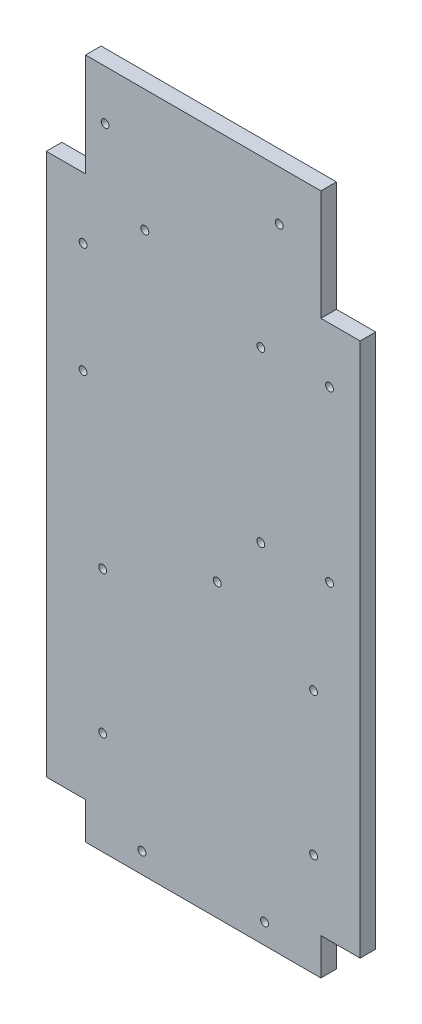
ISO-10303-21;
HEADER;
FILE_DESCRIPTION(('STEP AP214'),'2;1');
FILE_NAME('part.step','',(''),(''),'','','');
FILE_SCHEMA(('AUTOMOTIVE_DESIGN { 1 0 10303 214 1 1 1 1 }'));
ENDSEC;
DATA;
#1=APPLICATION_CONTEXT('core data for automotive mechanical design processes');
#2=APPLICATION_PROTOCOL_DEFINITION('international standard','automotive_design',2000,#1);
#3=PRODUCT_CONTEXT('',#1,'mechanical');
#4=PRODUCT('Part','Part','',(#3));
#5=PRODUCT_RELATED_PRODUCT_CATEGORY('part','',(#4));
#6=PRODUCT_DEFINITION_FORMATION('','',#4);
#7=PRODUCT_DEFINITION_CONTEXT('part definition',#1,'design');
#8=PRODUCT_DEFINITION('design','',#6,#7);
#9=PRODUCT_DEFINITION_SHAPE('','',#8);
#10=(LENGTH_UNIT() NAMED_UNIT(*) SI_UNIT(.MILLI.,.METRE.));
#11=(NAMED_UNIT(*) PLANE_ANGLE_UNIT() SI_UNIT($,.RADIAN.));
#12=(NAMED_UNIT(*) SI_UNIT($,.STERADIAN.) SOLID_ANGLE_UNIT());
#13=UNCERTAINTY_MEASURE_WITH_UNIT(LENGTH_MEASURE(1.E-05),#10,'distance_accuracy_value','');
#14=(GEOMETRIC_REPRESENTATION_CONTEXT(3) GLOBAL_UNCERTAINTY_ASSIGNED_CONTEXT((#13)) GLOBAL_UNIT_ASSIGNED_CONTEXT((#10,
#11,#12)) REPRESENTATION_CONTEXT('',''));
#15=CARTESIAN_POINT('',(0.,0.,0.));
#16=DIRECTION('',(0.,0.,1.));
#17=DIRECTION('',(1.,0.,0.));
#18=AXIS2_PLACEMENT_3D('',#15,#16,#17);
#19=CARTESIAN_POINT('',(0.,0.,6.35));
#20=DIRECTION('',(1.,0.,0.));
#21=DIRECTION('',(0.,0.,-1.));
#22=AXIS2_PLACEMENT_3D('',#19,#20,#21);
#23=PLANE('',#22);
#24=DIRECTION('',(0.,-1.,0.));
#25=VECTOR('',#24,1.);
#26=CARTESIAN_POINT('',(0.,0.,0.));
#27=LINE('',#26,#25);
#28=CARTESIAN_POINT('',(0.,236.,0.));
#29=VERTEX_POINT('',#28);
#30=CARTESIAN_POINT('',(0.,15.,0.));
#31=VERTEX_POINT('',#30);
#32=EDGE_CURVE('E169',#29,#31,#27,.T.);
#33=ORIENTED_EDGE('',*,*,#32,.T.);
#34=DIRECTION('',(0.,0.,1.));
#35=VECTOR('',#34,1.);
#36=CARTESIAN_POINT('',(0.,15.,-25.4125));
#37=LINE('',#36,#35);
#38=CARTESIAN_POINT('',(0.,15.,6.35));
#39=VERTEX_POINT('',#38);
#40=EDGE_CURVE('E280',#31,#39,#37,.T.);
#41=ORIENTED_EDGE('',*,*,#40,.T.);
#42=DIRECTION('',(0.,-1.,0.));
#43=VECTOR('',#42,1.);
#44=CARTESIAN_POINT('',(0.,0.,6.35));
#45=LINE('',#44,#43);
#46=CARTESIAN_POINT('',(0.,236.,6.35));
#47=VERTEX_POINT('',#46);
#48=EDGE_CURVE('E183',#47,#39,#45,.T.);
#49=ORIENTED_EDGE('',*,*,#48,.F.);
#50=DIRECTION('',(0.,0.,1.));
#51=VECTOR('',#50,1.);
#52=CARTESIAN_POINT('',(0.,236.,-25.4125));
#53=LINE('',#52,#51);
#54=EDGE_CURVE('E297',#29,#47,#53,.T.);
#55=ORIENTED_EDGE('',*,*,#54,.F.);
#56=EDGE_LOOP('',(#33,#41,#49,#55));
#57=FACE_BOUND('',#56,.T.);
#58=ADVANCED_FACE('F39',(#57),#23,.F.);
#59=CARTESIAN_POINT('',(0.,0.,6.35));
#60=DIRECTION('',(0.,1.,0.));
#61=DIRECTION('',(0.,0.,1.));
#62=AXIS2_PLACEMENT_3D('',#59,#60,#61);
#63=PLANE('',#62);
#64=DIRECTION('',(1.,0.,0.));
#65=VECTOR('',#64,1.);
#66=CARTESIAN_POINT('',(0.,0.,6.35));
#67=LINE('',#66,#65);
#68=CARTESIAN_POINT('',(16.,0.,6.35));
#69=VERTEX_POINT('',#68);
#70=CARTESIAN_POINT('',(112.,0.,6.35));
#71=VERTEX_POINT('',#70);
#72=EDGE_CURVE('E165',#69,#71,#67,.T.);
#73=ORIENTED_EDGE('',*,*,#72,.F.);
#74=DIRECTION('',(0.,0.,1.));
#75=VECTOR('',#74,1.);
#76=CARTESIAN_POINT('',(16.,0.,-25.4125));
#77=LINE('',#76,#75);
#78=CARTESIAN_POINT('',(16.,0.,0.));
#79=VERTEX_POINT('',#78);
#80=EDGE_CURVE('E274',#79,#69,#77,.T.);
#81=ORIENTED_EDGE('',*,*,#80,.F.);
#82=DIRECTION('',(1.,0.,0.));
#83=VECTOR('',#82,1.);
#84=CARTESIAN_POINT('',(0.,0.,0.));
#85=LINE('',#84,#83);
#86=CARTESIAN_POINT('',(112.,0.,0.));
#87=VERTEX_POINT('',#86);
#88=EDGE_CURVE('E173',#79,#87,#85,.T.);
#89=ORIENTED_EDGE('',*,*,#88,.T.);
#90=DIRECTION('',(0.,0.,1.));
#91=VECTOR('',#90,1.);
#92=CARTESIAN_POINT('',(112.,0.,-25.4125));
#93=LINE('',#92,#91);
#94=EDGE_CURVE('E152',#87,#71,#93,.T.);
#95=ORIENTED_EDGE('',*,*,#94,.T.);
#96=EDGE_LOOP('',(#73,#81,#89,#95));
#97=FACE_BOUND('',#96,.T.);
#98=ADVANCED_FACE('F315',(#97),#63,.F.);
#99=CARTESIAN_POINT('',(128.,0.,6.35));
#100=DIRECTION('',(-1.,0.,0.));
#101=DIRECTION('',(0.,0.,1.));
#102=AXIS2_PLACEMENT_3D('',#99,#100,#101);
#103=PLANE('',#102);
#104=DIRECTION('',(0.,1.,0.));
#105=VECTOR('',#104,1.);
#106=CARTESIAN_POINT('',(128.,0.,6.35));
#107=LINE('',#106,#105);
#108=CARTESIAN_POINT('',(128.,15.,6.35));
#109=VERTEX_POINT('',#108);
#110=CARTESIAN_POINT('',(128.,233.,6.35));
#111=VERTEX_POINT('',#110);
#112=EDGE_CURVE('E159',#109,#111,#107,.T.);
#113=ORIENTED_EDGE('',*,*,#112,.F.);
#114=DIRECTION('',(0.,0.,1.));
#115=VECTOR('',#114,1.);
#116=CARTESIAN_POINT('',(128.,15.,-25.4125));
#117=LINE('',#116,#115);
#118=CARTESIAN_POINT('',(128.,15.,0.));
#119=VERTEX_POINT('',#118);
#120=EDGE_CURVE('E277',#119,#109,#117,.T.);
#121=ORIENTED_EDGE('',*,*,#120,.F.);
#122=DIRECTION('',(0.,1.,0.));
#123=VECTOR('',#122,1.);
#124=CARTESIAN_POINT('',(128.,0.,0.));
#125=LINE('',#124,#123);
#126=CARTESIAN_POINT('',(128.,233.,0.));
#127=VERTEX_POINT('',#126);
#128=EDGE_CURVE('E177',#119,#127,#125,.T.);
#129=ORIENTED_EDGE('',*,*,#128,.T.);
#130=DIRECTION('',(0.,0.,1.));
#131=VECTOR('',#130,1.);
#132=CARTESIAN_POINT('',(128.,233.,-25.4125));
#133=LINE('',#132,#131);
#134=EDGE_CURVE('E294',#127,#111,#133,.T.);
#135=ORIENTED_EDGE('',*,*,#134,.T.);
#136=EDGE_LOOP('',(#113,#121,#129,#135));
#137=FACE_BOUND('',#136,.T.);
#138=ADVANCED_FACE('F437',(#137),#103,.F.);
#139=CARTESIAN_POINT('',(0.,278.,6.35));
#140=DIRECTION('',(0.,-1.,0.));
#141=DIRECTION('',(0.,0.,-1.));
#142=AXIS2_PLACEMENT_3D('',#139,#140,#141);
#143=PLANE('',#142);
#144=DIRECTION('',(-1.,0.,0.));
#145=VECTOR('',#144,1.);
#146=CARTESIAN_POINT('',(0.,278.,6.35));
#147=LINE('',#146,#145);
#148=CARTESIAN_POINT('',(112.,278.,6.35));
#149=VERTEX_POINT('',#148);
#150=CARTESIAN_POINT('',(16.,278.,6.35));
#151=VERTEX_POINT('',#150);
#152=EDGE_CURVE('E149',#149,#151,#147,.T.);
#153=ORIENTED_EDGE('',*,*,#152,.F.);
#154=DIRECTION('',(0.,0.,1.));
#155=VECTOR('',#154,1.);
#156=CARTESIAN_POINT('',(112.,278.,-25.4125));
#157=LINE('',#156,#155);
#158=CARTESIAN_POINT('',(112.,278.,0.));
#159=VERTEX_POINT('',#158);
#160=EDGE_CURVE('E129',#159,#149,#157,.T.);
#161=ORIENTED_EDGE('',*,*,#160,.F.);
#162=DIRECTION('',(-1.,0.,0.));
#163=VECTOR('',#162,1.);
#164=CARTESIAN_POINT('',(0.,278.,0.));
#165=LINE('',#164,#163);
#166=CARTESIAN_POINT('',(16.,278.,0.));
#167=VERTEX_POINT('',#166);
#168=EDGE_CURVE('E181',#159,#167,#165,.T.);
#169=ORIENTED_EDGE('',*,*,#168,.T.);
#170=DIRECTION('',(0.,0.,1.));
#171=VECTOR('',#170,1.);
#172=CARTESIAN_POINT('',(16.,278.,-25.4125));
#173=LINE('',#172,#171);
#174=EDGE_CURVE('E156',#167,#151,#173,.T.);
#175=ORIENTED_EDGE('',*,*,#174,.T.);
#176=EDGE_LOOP('',(#153,#161,#169,#175));
#177=FACE_BOUND('',#176,.T.);
#178=ADVANCED_FACE('F155',(#177),#143,.F.);
#179=CARTESIAN_POINT('',(0.,0.,6.35));
#180=DIRECTION('',(0.,0.,-1.));
#181=DIRECTION('',(-1.,0.,0.));
#182=AXIS2_PLACEMENT_3D('',#179,#180,#181);
#183=PLANE('',#182);
#184=CARTESIAN_POINT('',(15.,211.,6.35));
#185=DIRECTION('',(0.,0.,1.));
#186=DIRECTION('',(1.,0.,0.));
#187=AXIS2_PLACEMENT_3D('',#184,#185,#186);
#188=CIRCLE('',#187,1.6);
#189=CARTESIAN_POINT('',(16.6,211.,6.35));
#190=VERTEX_POINT('',#189);
#191=EDGE_CURVE('E354',#190,#190,#188,.T.);
#192=ORIENTED_EDGE('',*,*,#191,.F.);
#193=EDGE_LOOP('',(#192));
#194=FACE_BOUND('',#193,.T.);
#195=CARTESIAN_POINT('',(40.197400927512,228.25,6.35));
#196=DIRECTION('',(0.,0.,1.));
#197=DIRECTION('',(1.,0.,0.));
#198=AXIS2_PLACEMENT_3D('',#195,#196,#197);
#199=CIRCLE('',#198,1.60000000000002);
#200=CARTESIAN_POINT('',(41.797400927512,228.25,6.35));
#201=VERTEX_POINT('',#200);
#202=EDGE_CURVE('E358',#201,#201,#199,.T.);
#203=ORIENTED_EDGE('',*,*,#202,.F.);
#204=EDGE_LOOP('',(#203));
#205=FACE_BOUND('',#204,.T.);
#206=CARTESIAN_POINT('',(69.697400927512,118.75,6.35));
#207=DIRECTION('',(0.,0.,1.));
#208=DIRECTION('',(1.,0.,0.));
#209=AXIS2_PLACEMENT_3D('',#206,#207,#208);
#210=CIRCLE('',#209,1.60000000000001);
#211=CARTESIAN_POINT('',(71.297400927512,118.75,6.35));
#212=VERTEX_POINT('',#211);
#213=EDGE_CURVE('E363',#212,#212,#210,.T.);
#214=ORIENTED_EDGE('',*,*,#213,.F.);
#215=EDGE_LOOP('',(#214));
#216=FACE_BOUND('',#215,.T.);
#217=CARTESIAN_POINT('',(115.5,141.5,6.35));
#218=DIRECTION('',(0.,0.,1.));
#219=DIRECTION('',(1.,0.,0.));
#220=AXIS2_PLACEMENT_3D('',#217,#218,#219);
#221=CIRCLE('',#220,1.6);
#222=CARTESIAN_POINT('',(117.1,141.5,6.35));
#223=VERTEX_POINT('',#222);
#224=EDGE_CURVE('E350',#223,#223,#221,.T.);
#225=ORIENTED_EDGE('',*,*,#224,.F.);
#226=EDGE_LOOP('',(#225));
#227=FACE_BOUND('',#226,.T.);
#228=CARTESIAN_POINT('',(95.,257.75,6.35));
#229=DIRECTION('',(0.,0.,1.));
#230=DIRECTION('',(1.,0.,0.));
#231=AXIS2_PLACEMENT_3D('',#228,#229,#230);
#232=CIRCLE('',#231,1.59999999999998);
#233=CARTESIAN_POINT('',(96.6,257.75,6.35));
#234=VERTEX_POINT('',#233);
#235=EDGE_CURVE('E337',#234,#234,#232,.T.);
#236=ORIENTED_EDGE('',*,*,#235,.F.);
#237=EDGE_LOOP('',(#236));
#238=FACE_BOUND('',#237,.T.);
#239=CARTESIAN_POINT('',(87.5,210.5,6.35));
#240=DIRECTION('',(0.,0.,1.));
#241=DIRECTION('',(1.,0.,0.));
#242=AXIS2_PLACEMENT_3D('',#239,#240,#241);
#243=CIRCLE('',#242,1.6);
#244=CARTESIAN_POINT('',(89.1,210.5,6.35));
#245=VERTEX_POINT('',#244);
#246=EDGE_CURVE('E338',#245,#245,#243,.T.);
#247=ORIENTED_EDGE('',*,*,#246,.F.);
#248=EDGE_LOOP('',(#247));
#249=FACE_BOUND('',#248,.T.);
#250=CARTESIAN_POINT('',(115.5,210.5,6.35));
#251=DIRECTION('',(0.,0.,1.));
#252=DIRECTION('',(1.,0.,0.));
#253=AXIS2_PLACEMENT_3D('',#250,#251,#252);
#254=CIRCLE('',#253,1.6);
#255=CARTESIAN_POINT('',(117.1,210.5,6.35));
#256=VERTEX_POINT('',#255);
#257=EDGE_CURVE('E342',#256,#256,#254,.T.);
#258=ORIENTED_EDGE('',*,*,#257,.F.);
#259=EDGE_LOOP('',(#258));
#260=FACE_BOUND('',#259,.T.);
#261=CARTESIAN_POINT('',(87.5,141.5,6.35));
#262=DIRECTION('',(0.,0.,1.));
#263=DIRECTION('',(1.,0.,0.));
#264=AXIS2_PLACEMENT_3D('',#261,#262,#263);
#265=CIRCLE('',#264,1.6);
#266=CARTESIAN_POINT('',(89.1,141.5,6.35));
#267=VERTEX_POINT('',#266);
#268=EDGE_CURVE('E346',#267,#267,#265,.T.);
#269=ORIENTED_EDGE('',*,*,#268,.F.);
#270=EDGE_LOOP('',(#269));
#271=FACE_BOUND('',#270,.T.);
#272=CARTESIAN_POINT('',(109.,100.,6.35));
#273=DIRECTION('',(0.,0.,1.));
#274=DIRECTION('',(1.,0.,0.));
#275=AXIS2_PLACEMENT_3D('',#272,#273,#274);
#276=CIRCLE('',#275,1.60000000000001);
#277=CARTESIAN_POINT('',(110.6,100.,6.35));
#278=VERTEX_POINT('',#277);
#279=EDGE_CURVE('E386',#278,#278,#276,.T.);
#280=ORIENTED_EDGE('',*,*,#279,.F.);
#281=EDGE_LOOP('',(#280));
#282=FACE_BOUND('',#281,.T.);
#283=CARTESIAN_POINT('',(109.,42.,6.35));
#284=DIRECTION('',(0.,0.,1.));
#285=DIRECTION('',(1.,0.,0.));
#286=AXIS2_PLACEMENT_3D('',#283,#284,#285);
#287=CIRCLE('',#286,1.60000000000001);
#288=CARTESIAN_POINT('',(110.6,42.,6.35));
#289=VERTEX_POINT('',#288);
#290=EDGE_CURVE('E390',#289,#289,#287,.T.);
#291=ORIENTED_EDGE('',*,*,#290,.F.);
#292=EDGE_LOOP('',(#291));
#293=FACE_BOUND('',#292,.T.);
#294=CARTESIAN_POINT('',(23.,42.,6.35));
#295=DIRECTION('',(0.,0.,1.));
#296=DIRECTION('',(1.,0.,0.));
#297=AXIS2_PLACEMENT_3D('',#294,#295,#296);
#298=CIRCLE('',#297,1.6);
#299=CARTESIAN_POINT('',(24.6,42.,6.35));
#300=VERTEX_POINT('',#299);
#301=EDGE_CURVE('E382',#300,#300,#298,.T.);
#302=ORIENTED_EDGE('',*,*,#301,.F.);
#303=EDGE_LOOP('',(#302));
#304=FACE_BOUND('',#303,.T.);
#305=CARTESIAN_POINT('',(15.,166.,6.35));
#306=DIRECTION('',(0.,0.,1.));
#307=DIRECTION('',(1.,0.,0.));
#308=AXIS2_PLACEMENT_3D('',#305,#306,#307);
#309=CIRCLE('',#308,1.60000000000003);
#310=CARTESIAN_POINT('',(16.6,166.,6.35));
#311=VERTEX_POINT('',#310);
#312=EDGE_CURVE('E359',#311,#311,#309,.T.);
#313=ORIENTED_EDGE('',*,*,#312,.F.);
#314=EDGE_LOOP('',(#313));
#315=FACE_BOUND('',#314,.T.);
#316=CARTESIAN_POINT('',(39.,8.30892703083148,6.35));
#317=DIRECTION('',(0.,0.,1.));
#318=DIRECTION('',(1.,0.,0.));
#319=AXIS2_PLACEMENT_3D('',#316,#317,#318);
#320=CIRCLE('',#319,1.6);
#321=CARTESIAN_POINT('',(40.6,8.30892703083148,6.35));
#322=VERTEX_POINT('',#321);
#323=EDGE_CURVE('E370',#322,#322,#320,.T.);
#324=ORIENTED_EDGE('',*,*,#323,.F.);
#325=EDGE_LOOP('',(#324));
#326=FACE_BOUND('',#325,.T.);
#327=CARTESIAN_POINT('',(89.,8.3089270308315,6.35));
#328=DIRECTION('',(0.,0.,1.));
#329=DIRECTION('',(1.,0.,0.));
#330=AXIS2_PLACEMENT_3D('',#327,#328,#329);
#331=CIRCLE('',#330,1.6);
#332=CARTESIAN_POINT('',(90.6,8.3089270308315,6.35));
#333=VERTEX_POINT('',#332);
#334=EDGE_CURVE('E374',#333,#333,#331,.T.);
#335=ORIENTED_EDGE('',*,*,#334,.F.);
#336=EDGE_LOOP('',(#335));
#337=FACE_BOUND('',#336,.T.);
#338=CARTESIAN_POINT('',(23.,100.,6.35));
#339=DIRECTION('',(0.,0.,1.));
#340=DIRECTION('',(1.,0.,0.));
#341=AXIS2_PLACEMENT_3D('',#338,#339,#340);
#342=CIRCLE('',#341,1.60000000000001);
#343=CARTESIAN_POINT('',(24.6,100.,6.35));
#344=VERTEX_POINT('',#343);
#345=EDGE_CURVE('E378',#344,#344,#342,.T.);
#346=ORIENTED_EDGE('',*,*,#345,.F.);
#347=EDGE_LOOP('',(#346));
#348=FACE_BOUND('',#347,.T.);
#349=CARTESIAN_POINT('',(24.,257.75,6.35));
#350=DIRECTION('',(0.,0.,1.));
#351=DIRECTION('',(1.,0.,0.));
#352=AXIS2_PLACEMENT_3D('',#349,#350,#351);
#353=CIRCLE('',#352,1.6);
#354=CARTESIAN_POINT('',(25.6,257.75,6.35));
#355=VERTEX_POINT('',#354);
#356=EDGE_CURVE('E207',#355,#355,#353,.T.);
#357=ORIENTED_EDGE('',*,*,#356,.F.);
#358=EDGE_LOOP('',(#357));
#359=FACE_BOUND('',#358,.T.);
#360=ORIENTED_EDGE('',*,*,#48,.T.);
#361=DIRECTION('',(-1.,0.,0.));
#362=VECTOR('',#361,1.);
#363=CARTESIAN_POINT('',(0.,15.,6.35));
#364=LINE('',#363,#362);
#365=CARTESIAN_POINT('',(16.,15.,6.35));
#366=VERTEX_POINT('',#365);
#367=EDGE_CURVE('E269',#366,#39,#364,.T.);
#368=ORIENTED_EDGE('',*,*,#367,.F.);
#369=DIRECTION('',(0.,1.,0.));
#370=VECTOR('',#369,1.);
#371=CARTESIAN_POINT('',(16.,0.,6.35));
#372=LINE('',#371,#370);
#373=EDGE_CURVE('E265',#69,#366,#372,.T.);
#374=ORIENTED_EDGE('',*,*,#373,.F.);
#375=ORIENTED_EDGE('',*,*,#72,.T.);
#376=DIRECTION('',(0.,-1.,0.));
#377=VECTOR('',#376,1.);
#378=CARTESIAN_POINT('',(112.,0.,6.35));
#379=LINE('',#378,#377);
#380=CARTESIAN_POINT('',(112.,15.,6.35));
#381=VERTEX_POINT('',#380);
#382=EDGE_CURVE('E311',#381,#71,#379,.T.);
#383=ORIENTED_EDGE('',*,*,#382,.F.);
#384=DIRECTION('',(-1.,0.,0.));
#385=VECTOR('',#384,1.);
#386=CARTESIAN_POINT('',(128.,15.,6.35));
#387=LINE('',#386,#385);
#388=EDGE_CURVE('E284',#109,#381,#387,.T.);
#389=ORIENTED_EDGE('',*,*,#388,.F.);
#390=ORIENTED_EDGE('',*,*,#112,.T.);
#391=DIRECTION('',(1.,0.,0.));
#392=VECTOR('',#391,1.);
#393=CARTESIAN_POINT('',(128.,233.,6.35));
#394=LINE('',#393,#392);
#395=CARTESIAN_POINT('',(112.,233.,6.35));
#396=VERTEX_POINT('',#395);
#397=EDGE_CURVE('E142',#396,#111,#394,.T.);
#398=ORIENTED_EDGE('',*,*,#397,.F.);
#399=DIRECTION('',(0.,-1.,0.));
#400=VECTOR('',#399,1.);
#401=CARTESIAN_POINT('',(112.,278.,6.35));
#402=LINE('',#401,#400);
#403=EDGE_CURVE('E132',#149,#396,#402,.T.);
#404=ORIENTED_EDGE('',*,*,#403,.F.);
#405=ORIENTED_EDGE('',*,*,#152,.T.);
#406=DIRECTION('',(0.,1.,0.));
#407=VECTOR('',#406,1.);
#408=CARTESIAN_POINT('',(16.,278.,6.35));
#409=LINE('',#408,#407);
#410=CARTESIAN_POINT('',(16.,236.,6.35));
#411=VERTEX_POINT('',#410);
#412=EDGE_CURVE('E293',#411,#151,#409,.T.);
#413=ORIENTED_EDGE('',*,*,#412,.F.);
#414=DIRECTION('',(1.,0.,0.));
#415=VECTOR('',#414,1.);
#416=CARTESIAN_POINT('',(0.,236.,6.35));
#417=LINE('',#416,#415);
#418=EDGE_CURVE('E289',#47,#411,#417,.T.);
#419=ORIENTED_EDGE('',*,*,#418,.F.);
#420=EDGE_LOOP('',(#360,#368,#374,#375,#383,#389,#390,#398,#404,#405,#413,#419));
#421=FACE_BOUND('',#420,.T.);
#422=ADVANCED_FACE('F147',(#194,#205,#216,#227,#238,#249,#260,#271,#282,#293,#304,#315,#326,
#337,#348,#359,#421),#183,.F.);
#423=CARTESIAN_POINT('',(0.,0.,0.));
#424=DIRECTION('',(0.,0.,-1.));
#425=DIRECTION('',(-1.,0.,0.));
#426=AXIS2_PLACEMENT_3D('',#423,#424,#425);
#427=PLANE('',#426);
#428=CARTESIAN_POINT('',(15.,211.,0.));
#429=DIRECTION('',(0.,0.,-1.));
#430=DIRECTION('',(-1.,0.,0.));
#431=AXIS2_PLACEMENT_3D('',#428,#429,#430);
#432=CIRCLE('',#431,1.6);
#433=CARTESIAN_POINT('',(13.4,211.,0.));
#434=VERTEX_POINT('',#433);
#435=EDGE_CURVE('E42',#434,#434,#432,.T.);
#436=ORIENTED_EDGE('',*,*,#435,.F.);
#437=EDGE_LOOP('',(#436));
#438=FACE_BOUND('',#437,.T.);
#439=CARTESIAN_POINT('',(40.197400927512,228.25,0.));
#440=DIRECTION('',(0.,0.,-1.));
#441=DIRECTION('',(-1.,0.,0.));
#442=AXIS2_PLACEMENT_3D('',#439,#440,#441);
#443=CIRCLE('',#442,1.60000000000002);
#444=CARTESIAN_POINT('',(38.5974009275119,228.25,0.));
#445=VERTEX_POINT('',#444);
#446=EDGE_CURVE('E258',#445,#445,#443,.T.);
#447=ORIENTED_EDGE('',*,*,#446,.F.);
#448=EDGE_LOOP('',(#447));
#449=FACE_BOUND('',#448,.T.);
#450=CARTESIAN_POINT('',(69.697400927512,118.75,0.));
#451=DIRECTION('',(0.,0.,-1.));
#452=DIRECTION('',(-1.,0.,0.));
#453=AXIS2_PLACEMENT_3D('',#450,#451,#452);
#454=CIRCLE('',#453,1.60000000000001);
#455=CARTESIAN_POINT('',(68.097400927512,118.75,0.));
#456=VERTEX_POINT('',#455);
#457=EDGE_CURVE('E255',#456,#456,#454,.T.);
#458=ORIENTED_EDGE('',*,*,#457,.F.);
#459=EDGE_LOOP('',(#458));
#460=FACE_BOUND('',#459,.T.);
#461=CARTESIAN_POINT('',(115.5,141.5,0.));
#462=DIRECTION('',(0.,0.,-1.));
#463=DIRECTION('',(-1.,0.,0.));
#464=AXIS2_PLACEMENT_3D('',#461,#462,#463);
#465=CIRCLE('',#464,1.6);
#466=CARTESIAN_POINT('',(113.9,141.5,0.));
#467=VERTEX_POINT('',#466);
#468=EDGE_CURVE('E251',#467,#467,#465,.T.);
#469=ORIENTED_EDGE('',*,*,#468,.F.);
#470=EDGE_LOOP('',(#469));
#471=FACE_BOUND('',#470,.T.);
#472=CARTESIAN_POINT('',(95.,257.75,0.));
#473=DIRECTION('',(0.,0.,-1.));
#474=DIRECTION('',(-1.,0.,0.));
#475=AXIS2_PLACEMENT_3D('',#472,#473,#474);
#476=CIRCLE('',#475,1.59999999999998);
#477=CARTESIAN_POINT('',(93.4,257.75,0.));
#478=VERTEX_POINT('',#477);
#479=EDGE_CURVE('E247',#478,#478,#476,.T.);
#480=ORIENTED_EDGE('',*,*,#479,.F.);
#481=EDGE_LOOP('',(#480));
#482=FACE_BOUND('',#481,.T.);
#483=CARTESIAN_POINT('',(87.5,210.5,0.));
#484=DIRECTION('',(0.,0.,-1.));
#485=DIRECTION('',(-1.,0.,0.));
#486=AXIS2_PLACEMENT_3D('',#483,#484,#485);
#487=CIRCLE('',#486,1.6);
#488=CARTESIAN_POINT('',(85.9,210.5,0.));
#489=VERTEX_POINT('',#488);
#490=EDGE_CURVE('E243',#489,#489,#487,.T.);
#491=ORIENTED_EDGE('',*,*,#490,.F.);
#492=EDGE_LOOP('',(#491));
#493=FACE_BOUND('',#492,.T.);
#494=CARTESIAN_POINT('',(115.5,210.5,0.));
#495=DIRECTION('',(0.,0.,-1.));
#496=DIRECTION('',(-1.,0.,0.));
#497=AXIS2_PLACEMENT_3D('',#494,#495,#496);
#498=CIRCLE('',#497,1.6);
#499=CARTESIAN_POINT('',(113.9,210.5,0.));
#500=VERTEX_POINT('',#499);
#501=EDGE_CURVE('E239',#500,#500,#498,.T.);
#502=ORIENTED_EDGE('',*,*,#501,.F.);
#503=EDGE_LOOP('',(#502));
#504=FACE_BOUND('',#503,.T.);
#505=CARTESIAN_POINT('',(87.5,141.5,0.));
#506=DIRECTION('',(0.,0.,-1.));
#507=DIRECTION('',(-1.,0.,0.));
#508=AXIS2_PLACEMENT_3D('',#505,#506,#507);
#509=CIRCLE('',#508,1.6);
#510=CARTESIAN_POINT('',(85.9,141.5,0.));
#511=VERTEX_POINT('',#510);
#512=EDGE_CURVE('E235',#511,#511,#509,.T.);
#513=ORIENTED_EDGE('',*,*,#512,.F.);
#514=EDGE_LOOP('',(#513));
#515=FACE_BOUND('',#514,.T.);
#516=CARTESIAN_POINT('',(109.,100.,0.));
#517=DIRECTION('',(0.,0.,-1.));
#518=DIRECTION('',(-1.,0.,0.));
#519=AXIS2_PLACEMENT_3D('',#516,#517,#518);
#520=CIRCLE('',#519,1.60000000000001);
#521=CARTESIAN_POINT('',(107.4,100.,0.));
#522=VERTEX_POINT('',#521);
#523=EDGE_CURVE('E231',#522,#522,#520,.T.);
#524=ORIENTED_EDGE('',*,*,#523,.F.);
#525=EDGE_LOOP('',(#524));
#526=FACE_BOUND('',#525,.T.);
#527=CARTESIAN_POINT('',(109.,42.,0.));
#528=DIRECTION('',(0.,0.,-1.));
#529=DIRECTION('',(-1.,0.,0.));
#530=AXIS2_PLACEMENT_3D('',#527,#528,#529);
#531=CIRCLE('',#530,1.60000000000001);
#532=CARTESIAN_POINT('',(107.4,42.,0.));
#533=VERTEX_POINT('',#532);
#534=EDGE_CURVE('E227',#533,#533,#531,.T.);
#535=ORIENTED_EDGE('',*,*,#534,.F.);
#536=EDGE_LOOP('',(#535));
#537=FACE_BOUND('',#536,.T.);
#538=CARTESIAN_POINT('',(23.,42.,0.));
#539=DIRECTION('',(0.,0.,-1.));
#540=DIRECTION('',(-1.,0.,0.));
#541=AXIS2_PLACEMENT_3D('',#538,#539,#540);
#542=CIRCLE('',#541,1.6);
#543=CARTESIAN_POINT('',(21.4,42.,0.));
#544=VERTEX_POINT('',#543);
#545=EDGE_CURVE('E223',#544,#544,#542,.T.);
#546=ORIENTED_EDGE('',*,*,#545,.F.);
#547=EDGE_LOOP('',(#546));
#548=FACE_BOUND('',#547,.T.);
#549=CARTESIAN_POINT('',(15.,166.,0.));
#550=DIRECTION('',(0.,0.,-1.));
#551=DIRECTION('',(-1.,0.,0.));
#552=AXIS2_PLACEMENT_3D('',#549,#550,#551);
#553=CIRCLE('',#552,1.60000000000003);
#554=CARTESIAN_POINT('',(13.4,166.,0.));
#555=VERTEX_POINT('',#554);
#556=EDGE_CURVE('E219',#555,#555,#553,.T.);
#557=ORIENTED_EDGE('',*,*,#556,.F.);
#558=EDGE_LOOP('',(#557));
#559=FACE_BOUND('',#558,.T.);
#560=CARTESIAN_POINT('',(39.,8.30892703083148,0.));
#561=DIRECTION('',(0.,0.,-1.));
#562=DIRECTION('',(-1.,0.,0.));
#563=AXIS2_PLACEMENT_3D('',#560,#561,#562);
#564=CIRCLE('',#563,1.6);
#565=CARTESIAN_POINT('',(37.4,8.30892703083148,0.));
#566=VERTEX_POINT('',#565);
#567=EDGE_CURVE('E215',#566,#566,#564,.T.);
#568=ORIENTED_EDGE('',*,*,#567,.F.);
#569=EDGE_LOOP('',(#568));
#570=FACE_BOUND('',#569,.T.);
#571=CARTESIAN_POINT('',(89.,8.3089270308315,0.));
#572=DIRECTION('',(0.,0.,-1.));
#573=DIRECTION('',(-1.,0.,0.));
#574=AXIS2_PLACEMENT_3D('',#571,#572,#573);
#575=CIRCLE('',#574,1.6);
#576=CARTESIAN_POINT('',(87.4,8.3089270308315,0.));
#577=VERTEX_POINT('',#576);
#578=EDGE_CURVE('E211',#577,#577,#575,.T.);
#579=ORIENTED_EDGE('',*,*,#578,.F.);
#580=EDGE_LOOP('',(#579));
#581=FACE_BOUND('',#580,.T.);
#582=CARTESIAN_POINT('',(23.,100.,0.));
#583=DIRECTION('',(0.,0.,-1.));
#584=DIRECTION('',(-1.,0.,0.));
#585=AXIS2_PLACEMENT_3D('',#582,#583,#584);
#586=CIRCLE('',#585,1.60000000000001);
#587=CARTESIAN_POINT('',(21.4,100.,0.));
#588=VERTEX_POINT('',#587);
#589=EDGE_CURVE('E206',#588,#588,#586,.T.);
#590=ORIENTED_EDGE('',*,*,#589,.F.);
#591=EDGE_LOOP('',(#590));
#592=FACE_BOUND('',#591,.T.);
#593=CARTESIAN_POINT('',(24.,257.75,0.));
#594=DIRECTION('',(0.,0.,-1.));
#595=DIRECTION('',(-1.,0.,0.));
#596=AXIS2_PLACEMENT_3D('',#593,#594,#595);
#597=CIRCLE('',#596,1.6);
#598=CARTESIAN_POINT('',(22.4,257.75,0.));
#599=VERTEX_POINT('',#598);
#600=EDGE_CURVE('E202',#599,#599,#597,.T.);
#601=ORIENTED_EDGE('',*,*,#600,.F.);
#602=EDGE_LOOP('',(#601));
#603=FACE_BOUND('',#602,.T.);
#604=DIRECTION('',(1.,0.,0.));
#605=VECTOR('',#604,1.);
#606=CARTESIAN_POINT('',(0.,15.,0.));
#607=LINE('',#606,#605);
#608=CARTESIAN_POINT('',(16.,15.,0.));
#609=VERTEX_POINT('',#608);
#610=EDGE_CURVE('E11',#31,#609,#607,.T.);
#611=ORIENTED_EDGE('',*,*,#610,.F.);
#612=ORIENTED_EDGE('',*,*,#32,.F.);
#613=DIRECTION('',(-1.,0.,0.));
#614=VECTOR('',#613,1.);
#615=CARTESIAN_POINT('',(0.,236.,0.));
#616=LINE('',#615,#614);
#617=CARTESIAN_POINT('',(16.,236.,0.));
#618=VERTEX_POINT('',#617);
#619=EDGE_CURVE('E158',#618,#29,#616,.T.);
#620=ORIENTED_EDGE('',*,*,#619,.F.);
#621=DIRECTION('',(0.,-1.,0.));
#622=VECTOR('',#621,1.);
#623=CARTESIAN_POINT('',(16.,0.,0.));
#624=LINE('',#623,#622);
#625=EDGE_CURVE('E163',#167,#618,#624,.T.);
#626=ORIENTED_EDGE('',*,*,#625,.F.);
#627=ORIENTED_EDGE('',*,*,#168,.F.);
#628=DIRECTION('',(0.,1.,0.));
#629=VECTOR('',#628,1.);
#630=CARTESIAN_POINT('',(112.,0.,0.));
#631=LINE('',#630,#629);
#632=CARTESIAN_POINT('',(112.,233.,0.));
#633=VERTEX_POINT('',#632);
#634=EDGE_CURVE('E135',#633,#159,#631,.T.);
#635=ORIENTED_EDGE('',*,*,#634,.F.);
#636=DIRECTION('',(-1.,0.,0.));
#637=VECTOR('',#636,1.);
#638=CARTESIAN_POINT('',(0.,233.,0.));
#639=LINE('',#638,#637);
#640=EDGE_CURVE('E190',#127,#633,#639,.T.);
#641=ORIENTED_EDGE('',*,*,#640,.F.);
#642=ORIENTED_EDGE('',*,*,#128,.F.);
#643=DIRECTION('',(1.,0.,0.));
#644=VECTOR('',#643,1.);
#645=CARTESIAN_POINT('',(0.,15.,0.));
#646=LINE('',#645,#644);
#647=CARTESIAN_POINT('',(112.,15.,0.));
#648=VERTEX_POINT('',#647);
#649=EDGE_CURVE('E194',#648,#119,#646,.T.);
#650=ORIENTED_EDGE('',*,*,#649,.F.);
#651=DIRECTION('',(0.,1.,0.));
#652=VECTOR('',#651,1.);
#653=CARTESIAN_POINT('',(112.,0.,0.));
#654=LINE('',#653,#652);
#655=EDGE_CURVE('E197',#87,#648,#654,.T.);
#656=ORIENTED_EDGE('',*,*,#655,.F.);
#657=ORIENTED_EDGE('',*,*,#88,.F.);
#658=DIRECTION('',(0.,-1.,0.));
#659=VECTOR('',#658,1.);
#660=CARTESIAN_POINT('',(16.,0.,0.));
#661=LINE('',#660,#659);
#662=EDGE_CURVE('E48',#609,#79,#661,.T.);
#663=ORIENTED_EDGE('',*,*,#662,.F.);
#664=EDGE_LOOP('',(#611,#612,#620,#626,#627,#635,#641,#642,#650,#656,#657,#663));
#665=FACE_BOUND('',#664,.T.);
#666=ADVANCED_FACE('F402',(#438,#449,#460,#471,#482,#493,#504,#515,#526,#537,#548,#559,#570,
#581,#592,#603,#665),#427,.T.);
#667=CARTESIAN_POINT('',(16.,278.,-25.4125));
#668=DIRECTION('',(1.,0.,0.));
#669=DIRECTION('',(0.,1.,0.));
#670=AXIS2_PLACEMENT_3D('',#667,#668,#669);
#671=PLANE('',#670);
#672=ORIENTED_EDGE('',*,*,#625,.T.);
#673=DIRECTION('',(0.,0.,1.));
#674=VECTOR('',#673,1.);
#675=CARTESIAN_POINT('',(16.,236.,-25.4125));
#676=LINE('',#675,#674);
#677=EDGE_CURVE('E300',#618,#411,#676,.T.);
#678=ORIENTED_EDGE('',*,*,#677,.T.);
#679=ORIENTED_EDGE('',*,*,#412,.T.);
#680=ORIENTED_EDGE('',*,*,#174,.F.);
#681=EDGE_LOOP('',(#672,#678,#679,#680));
#682=FACE_BOUND('',#681,.T.);
#683=ADVANCED_FACE('F451',(#682),#671,.F.);
#684=CARTESIAN_POINT('',(0.,236.,-25.4125));
#685=DIRECTION('',(0.,-1.,0.));
#686=DIRECTION('',(0.,0.,-1.));
#687=AXIS2_PLACEMENT_3D('',#684,#685,#686);
#688=PLANE('',#687);
#689=ORIENTED_EDGE('',*,*,#619,.T.);
#690=ORIENTED_EDGE('',*,*,#54,.T.);
#691=ORIENTED_EDGE('',*,*,#418,.T.);
#692=ORIENTED_EDGE('',*,*,#677,.F.);
#693=EDGE_LOOP('',(#689,#690,#691,#692));
#694=FACE_BOUND('',#693,.T.);
#695=ADVANCED_FACE('F449',(#694),#688,.F.);
#696=CARTESIAN_POINT('',(128.,233.,-25.4125));
#697=DIRECTION('',(0.,-1.,0.));
#698=DIRECTION('',(0.,0.,-1.));
#699=AXIS2_PLACEMENT_3D('',#696,#697,#698);
#700=PLANE('',#699);
#701=ORIENTED_EDGE('',*,*,#640,.T.);
#702=DIRECTION('',(0.,0.,1.));
#703=VECTOR('',#702,1.);
#704=CARTESIAN_POINT('',(112.,233.,-25.4125));
#705=LINE('',#704,#703);
#706=EDGE_CURVE('E141',#633,#396,#705,.T.);
#707=ORIENTED_EDGE('',*,*,#706,.T.);
#708=ORIENTED_EDGE('',*,*,#397,.T.);
#709=ORIENTED_EDGE('',*,*,#134,.F.);
#710=EDGE_LOOP('',(#701,#707,#708,#709));
#711=FACE_BOUND('',#710,.T.);
#712=ADVANCED_FACE('F469',(#711),#700,.F.);
#713=CARTESIAN_POINT('',(112.,278.,-25.4125));
#714=DIRECTION('',(-1.,0.,0.));
#715=DIRECTION('',(0.,0.,1.));
#716=AXIS2_PLACEMENT_3D('',#713,#714,#715);
#717=PLANE('',#716);
#718=ORIENTED_EDGE('',*,*,#634,.T.);
#719=ORIENTED_EDGE('',*,*,#160,.T.);
#720=ORIENTED_EDGE('',*,*,#403,.T.);
#721=ORIENTED_EDGE('',*,*,#706,.F.);
#722=EDGE_LOOP('',(#718,#719,#720,#721));
#723=FACE_BOUND('',#722,.T.);
#724=ADVANCED_FACE('F131',(#723),#717,.F.);
#725=CARTESIAN_POINT('',(112.,0.,-25.4125));
#726=DIRECTION('',(-1.,0.,0.));
#727=DIRECTION('',(0.,0.,1.));
#728=AXIS2_PLACEMENT_3D('',#725,#726,#727);
#729=PLANE('',#728);
#730=ORIENTED_EDGE('',*,*,#655,.T.);
#731=DIRECTION('',(0.,0.,1.));
#732=VECTOR('',#731,1.);
#733=CARTESIAN_POINT('',(112.,15.,-25.4125));
#734=LINE('',#733,#732);
#735=EDGE_CURVE('E63',#648,#381,#734,.T.);
#736=ORIENTED_EDGE('',*,*,#735,.T.);
#737=ORIENTED_EDGE('',*,*,#382,.T.);
#738=ORIENTED_EDGE('',*,*,#94,.F.);
#739=EDGE_LOOP('',(#730,#736,#737,#738));
#740=FACE_BOUND('',#739,.T.);
#741=ADVANCED_FACE('F461',(#740),#729,.F.);
#742=CARTESIAN_POINT('',(128.,15.,-25.4125));
#743=DIRECTION('',(0.,1.,0.));
#744=DIRECTION('',(-1.,0.,0.));
#745=AXIS2_PLACEMENT_3D('',#742,#743,#744);
#746=PLANE('',#745);
#747=ORIENTED_EDGE('',*,*,#649,.T.);
#748=ORIENTED_EDGE('',*,*,#120,.T.);
#749=ORIENTED_EDGE('',*,*,#388,.T.);
#750=ORIENTED_EDGE('',*,*,#735,.F.);
#751=EDGE_LOOP('',(#747,#748,#749,#750));
#752=FACE_BOUND('',#751,.T.);
#753=ADVANCED_FACE('F460',(#752),#746,.F.);
#754=CARTESIAN_POINT('',(0.,15.,-25.4125));
#755=DIRECTION('',(0.,1.,0.));
#756=DIRECTION('',(0.,0.,1.));
#757=AXIS2_PLACEMENT_3D('',#754,#755,#756);
#758=PLANE('',#757);
#759=ORIENTED_EDGE('',*,*,#610,.T.);
#760=DIRECTION('',(0.,0.,1.));
#761=VECTOR('',#760,1.);
#762=CARTESIAN_POINT('',(16.,15.,-25.4125));
#763=LINE('',#762,#761);
#764=EDGE_CURVE('E56',#609,#366,#763,.T.);
#765=ORIENTED_EDGE('',*,*,#764,.T.);
#766=ORIENTED_EDGE('',*,*,#367,.T.);
#767=ORIENTED_EDGE('',*,*,#40,.F.);
#768=EDGE_LOOP('',(#759,#765,#766,#767));
#769=FACE_BOUND('',#768,.T.);
#770=ADVANCED_FACE('F428',(#769),#758,.F.);
#771=CARTESIAN_POINT('',(16.,0.,-25.4125));
#772=DIRECTION('',(1.,0.,0.));
#773=DIRECTION('',(0.,1.,0.));
#774=AXIS2_PLACEMENT_3D('',#771,#772,#773);
#775=PLANE('',#774);
#776=ORIENTED_EDGE('',*,*,#662,.T.);
#777=ORIENTED_EDGE('',*,*,#80,.T.);
#778=ORIENTED_EDGE('',*,*,#373,.T.);
#779=ORIENTED_EDGE('',*,*,#764,.F.);
#780=EDGE_LOOP('',(#776,#777,#778,#779));
#781=FACE_BOUND('',#780,.T.);
#782=ADVANCED_FACE('F418',(#781),#775,.F.);
#783=CARTESIAN_POINT('',(24.,257.75,-3.65));
#784=DIRECTION('',(0.,0.,1.));
#785=DIRECTION('',(1.,0.,0.));
#786=AXIS2_PLACEMENT_3D('',#783,#784,#785);
#787=CYLINDRICAL_SURFACE('',#786,1.6);
#788=ORIENTED_EDGE('',*,*,#600,.T.);
#789=EDGE_LOOP('',(#788));
#790=FACE_BOUND('',#789,.T.);
#791=ORIENTED_EDGE('',*,*,#356,.T.);
#792=EDGE_LOOP('',(#791));
#793=FACE_BOUND('',#792,.T.);
#794=ADVANCED_FACE('F415',(#790,#793),#787,.F.);
#795=CARTESIAN_POINT('',(23.,100.,-3.65));
#796=DIRECTION('',(0.,0.,1.));
#797=DIRECTION('',(1.,0.,0.));
#798=AXIS2_PLACEMENT_3D('',#795,#796,#797);
#799=CYLINDRICAL_SURFACE('',#798,1.60000000000001);
#800=ORIENTED_EDGE('',*,*,#589,.T.);
#801=EDGE_LOOP('',(#800));
#802=FACE_BOUND('',#801,.T.);
#803=ORIENTED_EDGE('',*,*,#345,.T.);
#804=EDGE_LOOP('',(#803));
#805=FACE_BOUND('',#804,.T.);
#806=ADVANCED_FACE('F417',(#802,#805),#799,.F.);
#807=CARTESIAN_POINT('',(89.,8.3089270308315,-3.65));
#808=DIRECTION('',(0.,0.,1.));
#809=DIRECTION('',(1.,0.,0.));
#810=AXIS2_PLACEMENT_3D('',#807,#808,#809);
#811=CYLINDRICAL_SURFACE('',#810,1.6);
#812=ORIENTED_EDGE('',*,*,#578,.T.);
#813=EDGE_LOOP('',(#812));
#814=FACE_BOUND('',#813,.T.);
#815=ORIENTED_EDGE('',*,*,#334,.T.);
#816=EDGE_LOOP('',(#815));
#817=FACE_BOUND('',#816,.T.);
#818=ADVANCED_FACE('F425',(#814,#817),#811,.F.);
#819=CARTESIAN_POINT('',(39.,8.30892703083148,-3.65));
#820=DIRECTION('',(0.,0.,1.));
#821=DIRECTION('',(1.,0.,0.));
#822=AXIS2_PLACEMENT_3D('',#819,#820,#821);
#823=CYLINDRICAL_SURFACE('',#822,1.6);
#824=ORIENTED_EDGE('',*,*,#567,.T.);
#825=EDGE_LOOP('',(#824));
#826=FACE_BOUND('',#825,.T.);
#827=ORIENTED_EDGE('',*,*,#323,.T.);
#828=EDGE_LOOP('',(#827));
#829=FACE_BOUND('',#828,.T.);
#830=ADVANCED_FACE('F558',(#826,#829),#823,.F.);
#831=CARTESIAN_POINT('',(15.,166.,-3.65));
#832=DIRECTION('',(0.,0.,1.));
#833=DIRECTION('',(1.,0.,0.));
#834=AXIS2_PLACEMENT_3D('',#831,#832,#833);
#835=CYLINDRICAL_SURFACE('',#834,1.60000000000003);
#836=ORIENTED_EDGE('',*,*,#556,.T.);
#837=EDGE_LOOP('',(#836));
#838=FACE_BOUND('',#837,.T.);
#839=ORIENTED_EDGE('',*,*,#312,.T.);
#840=EDGE_LOOP('',(#839));
#841=FACE_BOUND('',#840,.T.);
#842=ADVANCED_FACE('F567',(#838,#841),#835,.F.);
#843=CARTESIAN_POINT('',(23.,42.,-3.65));
#844=DIRECTION('',(0.,0.,1.));
#845=DIRECTION('',(1.,0.,0.));
#846=AXIS2_PLACEMENT_3D('',#843,#844,#845);
#847=CYLINDRICAL_SURFACE('',#846,1.6);
#848=ORIENTED_EDGE('',*,*,#545,.T.);
#849=EDGE_LOOP('',(#848));
#850=FACE_BOUND('',#849,.T.);
#851=ORIENTED_EDGE('',*,*,#301,.T.);
#852=EDGE_LOOP('',(#851));
#853=FACE_BOUND('',#852,.T.);
#854=ADVANCED_FACE('F398',(#850,#853),#847,.F.);
#855=CARTESIAN_POINT('',(109.,42.,-3.65));
#856=DIRECTION('',(0.,0.,1.));
#857=DIRECTION('',(1.,0.,0.));
#858=AXIS2_PLACEMENT_3D('',#855,#856,#857);
#859=CYLINDRICAL_SURFACE('',#858,1.60000000000001);
#860=ORIENTED_EDGE('',*,*,#534,.T.);
#861=EDGE_LOOP('',(#860));
#862=FACE_BOUND('',#861,.T.);
#863=ORIENTED_EDGE('',*,*,#290,.T.);
#864=EDGE_LOOP('',(#863));
#865=FACE_BOUND('',#864,.T.);
#866=ADVANCED_FACE('F584',(#862,#865),#859,.F.);
#867=CARTESIAN_POINT('',(109.,100.,-3.65));
#868=DIRECTION('',(0.,0.,1.));
#869=DIRECTION('',(1.,0.,0.));
#870=AXIS2_PLACEMENT_3D('',#867,#868,#869);
#871=CYLINDRICAL_SURFACE('',#870,1.60000000000001);
#872=ORIENTED_EDGE('',*,*,#523,.T.);
#873=EDGE_LOOP('',(#872));
#874=FACE_BOUND('',#873,.T.);
#875=ORIENTED_EDGE('',*,*,#279,.T.);
#876=EDGE_LOOP('',(#875));
#877=FACE_BOUND('',#876,.T.);
#878=ADVANCED_FACE('F593',(#874,#877),#871,.F.);
#879=CARTESIAN_POINT('',(87.5,141.5,-3.65));
#880=DIRECTION('',(0.,0.,1.));
#881=DIRECTION('',(1.,0.,0.));
#882=AXIS2_PLACEMENT_3D('',#879,#880,#881);
#883=CYLINDRICAL_SURFACE('',#882,1.6);
#884=ORIENTED_EDGE('',*,*,#512,.T.);
#885=EDGE_LOOP('',(#884));
#886=FACE_BOUND('',#885,.T.);
#887=ORIENTED_EDGE('',*,*,#268,.T.);
#888=EDGE_LOOP('',(#887));
#889=FACE_BOUND('',#888,.T.);
#890=ADVANCED_FACE('F602',(#886,#889),#883,.F.);
#891=CARTESIAN_POINT('',(115.5,210.5,-3.65));
#892=DIRECTION('',(0.,0.,1.));
#893=DIRECTION('',(1.,0.,0.));
#894=AXIS2_PLACEMENT_3D('',#891,#892,#893);
#895=CYLINDRICAL_SURFACE('',#894,1.6);
#896=ORIENTED_EDGE('',*,*,#501,.T.);
#897=EDGE_LOOP('',(#896));
#898=FACE_BOUND('',#897,.T.);
#899=ORIENTED_EDGE('',*,*,#257,.T.);
#900=EDGE_LOOP('',(#899));
#901=FACE_BOUND('',#900,.T.);
#902=ADVANCED_FACE('F611',(#898,#901),#895,.F.);
#903=CARTESIAN_POINT('',(87.5,210.5,-3.65));
#904=DIRECTION('',(0.,0.,1.));
#905=DIRECTION('',(1.,0.,0.));
#906=AXIS2_PLACEMENT_3D('',#903,#904,#905);
#907=CYLINDRICAL_SURFACE('',#906,1.6);
#908=ORIENTED_EDGE('',*,*,#490,.T.);
#909=EDGE_LOOP('',(#908));
#910=FACE_BOUND('',#909,.T.);
#911=ORIENTED_EDGE('',*,*,#246,.T.);
#912=EDGE_LOOP('',(#911));
#913=FACE_BOUND('',#912,.T.);
#914=ADVANCED_FACE('F620',(#910,#913),#907,.F.);
#915=CARTESIAN_POINT('',(95.,257.75,-3.65));
#916=DIRECTION('',(0.,0.,1.));
#917=DIRECTION('',(1.,0.,0.));
#918=AXIS2_PLACEMENT_3D('',#915,#916,#917);
#919=CYLINDRICAL_SURFACE('',#918,1.59999999999998);
#920=ORIENTED_EDGE('',*,*,#479,.T.);
#921=EDGE_LOOP('',(#920));
#922=FACE_BOUND('',#921,.T.);
#923=ORIENTED_EDGE('',*,*,#235,.T.);
#924=EDGE_LOOP('',(#923));
#925=FACE_BOUND('',#924,.T.);
#926=ADVANCED_FACE('F629',(#922,#925),#919,.F.);
#927=CARTESIAN_POINT('',(115.5,141.5,-3.65));
#928=DIRECTION('',(0.,0.,1.));
#929=DIRECTION('',(1.,0.,0.));
#930=AXIS2_PLACEMENT_3D('',#927,#928,#929);
#931=CYLINDRICAL_SURFACE('',#930,1.6);
#932=ORIENTED_EDGE('',*,*,#468,.T.);
#933=EDGE_LOOP('',(#932));
#934=FACE_BOUND('',#933,.T.);
#935=ORIENTED_EDGE('',*,*,#224,.T.);
#936=EDGE_LOOP('',(#935));
#937=FACE_BOUND('',#936,.T.);
#938=ADVANCED_FACE('F637',(#934,#937),#931,.F.);
#939=CARTESIAN_POINT('',(69.697400927512,118.75,-3.65));
#940=DIRECTION('',(0.,0.,1.));
#941=DIRECTION('',(1.,0.,0.));
#942=AXIS2_PLACEMENT_3D('',#939,#940,#941);
#943=CYLINDRICAL_SURFACE('',#942,1.60000000000001);
#944=ORIENTED_EDGE('',*,*,#457,.T.);
#945=EDGE_LOOP('',(#944));
#946=FACE_BOUND('',#945,.T.);
#947=ORIENTED_EDGE('',*,*,#213,.T.);
#948=EDGE_LOOP('',(#947));
#949=FACE_BOUND('',#948,.T.);
#950=ADVANCED_FACE('F646',(#946,#949),#943,.F.);
#951=CARTESIAN_POINT('',(40.197400927512,228.25,-3.65));
#952=DIRECTION('',(0.,0.,1.));
#953=DIRECTION('',(1.,0.,0.));
#954=AXIS2_PLACEMENT_3D('',#951,#952,#953);
#955=CYLINDRICAL_SURFACE('',#954,1.60000000000002);
#956=ORIENTED_EDGE('',*,*,#446,.T.);
#957=EDGE_LOOP('',(#956));
#958=FACE_BOUND('',#957,.T.);
#959=ORIENTED_EDGE('',*,*,#202,.T.);
#960=EDGE_LOOP('',(#959));
#961=FACE_BOUND('',#960,.T.);
#962=ADVANCED_FACE('F655',(#958,#961),#955,.F.);
#963=CARTESIAN_POINT('',(15.,211.,-3.65));
#964=DIRECTION('',(0.,0.,1.));
#965=DIRECTION('',(1.,0.,0.));
#966=AXIS2_PLACEMENT_3D('',#963,#964,#965);
#967=CYLINDRICAL_SURFACE('',#966,1.6);
#968=ORIENTED_EDGE('',*,*,#435,.T.);
#969=EDGE_LOOP('',(#968));
#970=FACE_BOUND('',#969,.T.);
#971=ORIENTED_EDGE('',*,*,#191,.T.);
#972=EDGE_LOOP('',(#971));
#973=FACE_BOUND('',#972,.T.);
#974=ADVANCED_FACE('F664',(#970,#973),#967,.F.);
#975=CLOSED_SHELL('',(#58,#98,#138,#178,#422,#666,#683,#695,#712,#724,#741,#753,#770,#782,#794,
#806,#818,#830,#842,#854,#866,#878,#890,#902,#914,#926,#938,#950,#962,#974));
#976=MANIFOLD_SOLID_BREP('B2',#975);
#977=ADVANCED_BREP_SHAPE_REPRESENTATION('',(#18,#976),#14);
#978=SHAPE_DEFINITION_REPRESENTATION(#9,#977);
ENDSEC;
END-ISO-10303-21;
